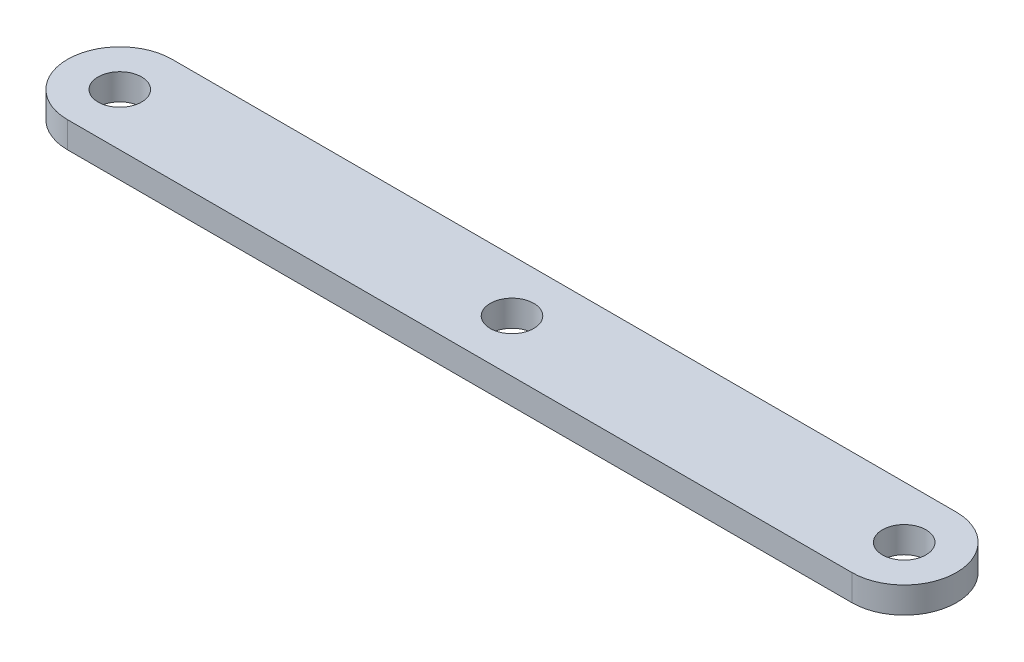
ISO-10303-21;
HEADER;
FILE_DESCRIPTION(('STEP AP214'),'2;1');
FILE_NAME('part.step','',(''),(''),'','','');
FILE_SCHEMA(('AUTOMOTIVE_DESIGN { 1 0 10303 214 1 1 1 1 }'));
ENDSEC;
DATA;
#1=APPLICATION_CONTEXT('core data for automotive mechanical design processes');
#2=APPLICATION_PROTOCOL_DEFINITION('international standard','automotive_design',2000,#1);
#3=PRODUCT_CONTEXT('',#1,'mechanical');
#4=PRODUCT('Part','Part','',(#3));
#5=PRODUCT_RELATED_PRODUCT_CATEGORY('part','',(#4));
#6=PRODUCT_DEFINITION_FORMATION('','',#4);
#7=PRODUCT_DEFINITION_CONTEXT('part definition',#1,'design');
#8=PRODUCT_DEFINITION('design','',#6,#7);
#9=PRODUCT_DEFINITION_SHAPE('','',#8);
#10=(LENGTH_UNIT() NAMED_UNIT(*) SI_UNIT(.MILLI.,.METRE.));
#11=(NAMED_UNIT(*) PLANE_ANGLE_UNIT() SI_UNIT($,.RADIAN.));
#12=(NAMED_UNIT(*) SI_UNIT($,.STERADIAN.) SOLID_ANGLE_UNIT());
#13=UNCERTAINTY_MEASURE_WITH_UNIT(LENGTH_MEASURE(1.E-05),#10,'distance_accuracy_value','');
#14=(GEOMETRIC_REPRESENTATION_CONTEXT(3) GLOBAL_UNCERTAINTY_ASSIGNED_CONTEXT((#13)) GLOBAL_UNIT_ASSIGNED_CONTEXT((#10,
#11,#12)) REPRESENTATION_CONTEXT('',''));
#15=CARTESIAN_POINT('',(0.,0.,0.));
#16=DIRECTION('',(0.,0.,1.));
#17=DIRECTION('',(1.,0.,0.));
#18=AXIS2_PLACEMENT_3D('',#15,#16,#17);
#19=CARTESIAN_POINT('',(-45.,3.,0.));
#20=DIRECTION('',(0.,-1.,0.));
#21=DIRECTION('',(0.,0.,-1.));
#22=AXIS2_PLACEMENT_3D('',#19,#20,#21);
#23=CYLINDRICAL_SURFACE('',#22,6.);
#24=CARTESIAN_POINT('',(-45.,0.,0.));
#25=DIRECTION('',(0.,1.,0.));
#26=DIRECTION('',(0.,0.,1.));
#27=AXIS2_PLACEMENT_3D('',#24,#25,#26);
#28=CIRCLE('',#27,6.);
#29=CARTESIAN_POINT('',(-45.,0.,-6.));
#30=VERTEX_POINT('',#29);
#31=CARTESIAN_POINT('',(-45.,0.,6.));
#32=VERTEX_POINT('',#31);
#33=EDGE_CURVE('E96',#30,#32,#28,.T.);
#34=ORIENTED_EDGE('',*,*,#33,.T.);
#35=DIRECTION('',(0.,-1.,0.));
#36=VECTOR('',#35,1.);
#37=CARTESIAN_POINT('',(-45.,3.,6.));
#38=LINE('',#37,#36);
#39=CARTESIAN_POINT('',(-45.,3.,6.));
#40=VERTEX_POINT('',#39);
#41=EDGE_CURVE('E11',#40,#32,#38,.T.);
#42=ORIENTED_EDGE('',*,*,#41,.F.);
#43=CARTESIAN_POINT('',(-45.,3.,0.));
#44=DIRECTION('',(0.,1.,0.));
#45=DIRECTION('',(0.,0.,1.));
#46=AXIS2_PLACEMENT_3D('',#43,#44,#45);
#47=CIRCLE('',#46,6.);
#48=CARTESIAN_POINT('',(-45.,3.,-6.));
#49=VERTEX_POINT('',#48);
#50=EDGE_CURVE('E84',#49,#40,#47,.T.);
#51=ORIENTED_EDGE('',*,*,#50,.F.);
#52=DIRECTION('',(0.,-1.,0.));
#53=VECTOR('',#52,1.);
#54=CARTESIAN_POINT('',(-45.,3.,-6.));
#55=LINE('',#54,#53);
#56=EDGE_CURVE('E92',#49,#30,#55,.T.);
#57=ORIENTED_EDGE('',*,*,#56,.T.);
#58=EDGE_LOOP('',(#34,#42,#51,#57));
#59=FACE_BOUND('',#58,.T.);
#60=ADVANCED_FACE('F33',(#59),#23,.T.);
#61=CARTESIAN_POINT('',(-45.,3.,6.));
#62=DIRECTION('',(0.,0.,-1.));
#63=DIRECTION('',(-1.,0.,0.));
#64=AXIS2_PLACEMENT_3D('',#61,#62,#63);
#65=PLANE('',#64);
#66=DIRECTION('',(1.,0.,0.));
#67=VECTOR('',#66,1.);
#68=CARTESIAN_POINT('',(-45.,0.,6.));
#69=LINE('',#68,#67);
#70=CARTESIAN_POINT('',(45.,0.,6.));
#71=VERTEX_POINT('',#70);
#72=EDGE_CURVE('E88',#32,#71,#69,.T.);
#73=ORIENTED_EDGE('',*,*,#72,.T.);
#74=DIRECTION('',(0.,-1.,0.));
#75=VECTOR('',#74,1.);
#76=CARTESIAN_POINT('',(45.,3.,6.));
#77=LINE('',#76,#75);
#78=CARTESIAN_POINT('',(45.,3.,6.));
#79=VERTEX_POINT('',#78);
#80=EDGE_CURVE('E41',#79,#71,#77,.T.);
#81=ORIENTED_EDGE('',*,*,#80,.F.);
#82=DIRECTION('',(1.,0.,0.));
#83=VECTOR('',#82,1.);
#84=CARTESIAN_POINT('',(-45.,3.,6.));
#85=LINE('',#84,#83);
#86=EDGE_CURVE('E79',#40,#79,#85,.T.);
#87=ORIENTED_EDGE('',*,*,#86,.F.);
#88=ORIENTED_EDGE('',*,*,#41,.T.);
#89=EDGE_LOOP('',(#73,#81,#87,#88));
#90=FACE_BOUND('',#89,.T.);
#91=ADVANCED_FACE('F87',(#90),#65,.F.);
#92=CARTESIAN_POINT('',(45.,3.,0.));
#93=DIRECTION('',(0.,-1.,0.));
#94=DIRECTION('',(0.,0.,-1.));
#95=AXIS2_PLACEMENT_3D('',#92,#93,#94);
#96=CYLINDRICAL_SURFACE('',#95,6.);
#97=CARTESIAN_POINT('',(45.,0.,0.));
#98=DIRECTION('',(0.,1.,0.));
#99=DIRECTION('',(0.,0.,1.));
#100=AXIS2_PLACEMENT_3D('',#97,#98,#99);
#101=CIRCLE('',#100,6.);
#102=CARTESIAN_POINT('',(45.,0.,-6.));
#103=VERTEX_POINT('',#102);
#104=EDGE_CURVE('E66',#71,#103,#101,.T.);
#105=ORIENTED_EDGE('',*,*,#104,.T.);
#106=DIRECTION('',(0.,-1.,0.));
#107=VECTOR('',#106,1.);
#108=CARTESIAN_POINT('',(45.,3.,-6.));
#109=LINE('',#108,#107);
#110=CARTESIAN_POINT('',(45.,3.,-6.));
#111=VERTEX_POINT('',#110);
#112=EDGE_CURVE('E89',#111,#103,#109,.T.);
#113=ORIENTED_EDGE('',*,*,#112,.F.);
#114=CARTESIAN_POINT('',(45.,3.,0.));
#115=DIRECTION('',(0.,1.,0.));
#116=DIRECTION('',(0.,0.,1.));
#117=AXIS2_PLACEMENT_3D('',#114,#115,#116);
#118=CIRCLE('',#117,6.);
#119=EDGE_CURVE('E82',#79,#111,#118,.T.);
#120=ORIENTED_EDGE('',*,*,#119,.F.);
#121=ORIENTED_EDGE('',*,*,#80,.T.);
#122=EDGE_LOOP('',(#105,#113,#120,#121));
#123=FACE_BOUND('',#122,.T.);
#124=ADVANCED_FACE('F90',(#123),#96,.T.);
#125=CARTESIAN_POINT('',(-45.,3.,-6.));
#126=DIRECTION('',(0.,0.,1.));
#127=DIRECTION('',(1.,0.,0.));
#128=AXIS2_PLACEMENT_3D('',#125,#126,#127);
#129=PLANE('',#128);
#130=DIRECTION('',(-1.,0.,0.));
#131=VECTOR('',#130,1.);
#132=CARTESIAN_POINT('',(-45.,0.,-6.));
#133=LINE('',#132,#131);
#134=EDGE_CURVE('E72',#103,#30,#133,.T.);
#135=ORIENTED_EDGE('',*,*,#134,.T.);
#136=ORIENTED_EDGE('',*,*,#56,.F.);
#137=DIRECTION('',(-1.,0.,0.));
#138=VECTOR('',#137,1.);
#139=CARTESIAN_POINT('',(-45.,3.,-6.));
#140=LINE('',#139,#138);
#141=EDGE_CURVE('E49',#111,#49,#140,.T.);
#142=ORIENTED_EDGE('',*,*,#141,.F.);
#143=ORIENTED_EDGE('',*,*,#112,.T.);
#144=EDGE_LOOP('',(#135,#136,#142,#143));
#145=FACE_BOUND('',#144,.T.);
#146=ADVANCED_FACE('F104',(#145),#129,.F.);
#147=CARTESIAN_POINT('',(-45.,3.,0.));
#148=DIRECTION('',(0.,1.,0.));
#149=DIRECTION('',(0.,0.,1.));
#150=AXIS2_PLACEMENT_3D('',#147,#148,#149);
#151=PLANE('',#150);
#152=CARTESIAN_POINT('',(-45.,3.,0.));
#153=DIRECTION('',(0.,1.,0.));
#154=DIRECTION('',(0.,0.,1.));
#155=AXIS2_PLACEMENT_3D('',#152,#153,#154);
#156=CIRCLE('',#155,2.5);
#157=CARTESIAN_POINT('',(-45.,3.,2.5));
#158=VERTEX_POINT('',#157);
#159=EDGE_CURVE('E120',#158,#158,#156,.T.);
#160=ORIENTED_EDGE('',*,*,#159,.F.);
#161=EDGE_LOOP('',(#160));
#162=FACE_BOUND('',#161,.T.);
#163=CARTESIAN_POINT('',(45.,3.,0.));
#164=DIRECTION('',(0.,1.,0.));
#165=DIRECTION('',(0.,0.,1.));
#166=AXIS2_PLACEMENT_3D('',#163,#164,#165);
#167=CIRCLE('',#166,2.5);
#168=CARTESIAN_POINT('',(45.,3.,2.5));
#169=VERTEX_POINT('',#168);
#170=EDGE_CURVE('E113',#169,#169,#167,.T.);
#171=ORIENTED_EDGE('',*,*,#170,.F.);
#172=EDGE_LOOP('',(#171));
#173=FACE_BOUND('',#172,.T.);
#174=CARTESIAN_POINT('',(0.,3.,0.));
#175=DIRECTION('',(0.,1.,0.));
#176=DIRECTION('',(0.,0.,1.));
#177=AXIS2_PLACEMENT_3D('',#174,#175,#176);
#178=CIRCLE('',#177,2.5);
#179=CARTESIAN_POINT('',(0.,3.,2.5));
#180=VERTEX_POINT('',#179);
#181=EDGE_CURVE('E114',#180,#180,#178,.T.);
#182=ORIENTED_EDGE('',*,*,#181,.F.);
#183=EDGE_LOOP('',(#182));
#184=FACE_BOUND('',#183,.T.);
#185=ORIENTED_EDGE('',*,*,#50,.T.);
#186=ORIENTED_EDGE('',*,*,#86,.T.);
#187=ORIENTED_EDGE('',*,*,#119,.T.);
#188=ORIENTED_EDGE('',*,*,#141,.T.);
#189=EDGE_LOOP('',(#185,#186,#187,#188));
#190=FACE_BOUND('',#189,.T.);
#191=ADVANCED_FACE('F80',(#162,#173,#184,#190),#151,.T.);
#192=CARTESIAN_POINT('',(-45.,0.,0.));
#193=DIRECTION('',(0.,1.,0.));
#194=DIRECTION('',(0.,0.,1.));
#195=AXIS2_PLACEMENT_3D('',#192,#193,#194);
#196=PLANE('',#195);
#197=CARTESIAN_POINT('',(-45.,0.,0.));
#198=DIRECTION('',(0.,1.,0.));
#199=DIRECTION('',(0.,0.,1.));
#200=AXIS2_PLACEMENT_3D('',#197,#198,#199);
#201=CIRCLE('',#200,2.5);
#202=CARTESIAN_POINT('',(-45.,0.,2.5));
#203=VERTEX_POINT('',#202);
#204=EDGE_CURVE('E99',#203,#203,#201,.F.);
#205=ORIENTED_EDGE('',*,*,#204,.F.);
#206=EDGE_LOOP('',(#205));
#207=FACE_BOUND('',#206,.T.);
#208=CARTESIAN_POINT('',(45.,0.,0.));
#209=DIRECTION('',(0.,1.,0.));
#210=DIRECTION('',(0.,0.,1.));
#211=AXIS2_PLACEMENT_3D('',#208,#209,#210);
#212=CIRCLE('',#211,2.5);
#213=CARTESIAN_POINT('',(45.,0.,2.5));
#214=VERTEX_POINT('',#213);
#215=EDGE_CURVE('E117',#214,#214,#212,.F.);
#216=ORIENTED_EDGE('',*,*,#215,.F.);
#217=EDGE_LOOP('',(#216));
#218=FACE_BOUND('',#217,.T.);
#219=CARTESIAN_POINT('',(0.,0.,0.));
#220=DIRECTION('',(0.,1.,0.));
#221=DIRECTION('',(0.,0.,1.));
#222=AXIS2_PLACEMENT_3D('',#219,#220,#221);
#223=CIRCLE('',#222,2.5);
#224=CARTESIAN_POINT('',(0.,0.,2.5));
#225=VERTEX_POINT('',#224);
#226=EDGE_CURVE('E110',#225,#225,#223,.F.);
#227=ORIENTED_EDGE('',*,*,#226,.F.);
#228=EDGE_LOOP('',(#227));
#229=FACE_BOUND('',#228,.T.);
#230=ORIENTED_EDGE('',*,*,#33,.F.);
#231=ORIENTED_EDGE('',*,*,#134,.F.);
#232=ORIENTED_EDGE('',*,*,#104,.F.);
#233=ORIENTED_EDGE('',*,*,#72,.F.);
#234=EDGE_LOOP('',(#230,#231,#232,#233));
#235=FACE_BOUND('',#234,.T.);
#236=ADVANCED_FACE('F107',(#207,#218,#229,#235),#196,.F.);
#237=CARTESIAN_POINT('',(0.,-0.00100000000000013,0.));
#238=DIRECTION('',(0.,1.,0.));
#239=DIRECTION('',(0.,0.,1.));
#240=AXIS2_PLACEMENT_3D('',#237,#238,#239);
#241=CYLINDRICAL_SURFACE('',#240,2.5);
#242=ORIENTED_EDGE('',*,*,#181,.T.);
#243=EDGE_LOOP('',(#242));
#244=FACE_BOUND('',#243,.T.);
#245=ORIENTED_EDGE('',*,*,#226,.T.);
#246=EDGE_LOOP('',(#245));
#247=FACE_BOUND('',#246,.T.);
#248=ADVANCED_FACE('F138',(#244,#247),#241,.F.);
#249=CARTESIAN_POINT('',(45.,-0.00100000000000013,0.));
#250=DIRECTION('',(0.,1.,0.));
#251=DIRECTION('',(0.,0.,1.));
#252=AXIS2_PLACEMENT_3D('',#249,#250,#251);
#253=CYLINDRICAL_SURFACE('',#252,2.5);
#254=ORIENTED_EDGE('',*,*,#170,.T.);
#255=EDGE_LOOP('',(#254));
#256=FACE_BOUND('',#255,.T.);
#257=ORIENTED_EDGE('',*,*,#215,.T.);
#258=EDGE_LOOP('',(#257));
#259=FACE_BOUND('',#258,.T.);
#260=ADVANCED_FACE('F141',(#256,#259),#253,.F.);
#261=CARTESIAN_POINT('',(-45.,-0.00100000000000013,0.));
#262=DIRECTION('',(0.,1.,0.));
#263=DIRECTION('',(0.,0.,1.));
#264=AXIS2_PLACEMENT_3D('',#261,#262,#263);
#265=CYLINDRICAL_SURFACE('',#264,2.5);
#266=ORIENTED_EDGE('',*,*,#159,.T.);
#267=EDGE_LOOP('',(#266));
#268=FACE_BOUND('',#267,.T.);
#269=ORIENTED_EDGE('',*,*,#204,.T.);
#270=EDGE_LOOP('',(#269));
#271=FACE_BOUND('',#270,.T.);
#272=ADVANCED_FACE('F128',(#268,#271),#265,.F.);
#273=CLOSED_SHELL('',(#60,#91,#124,#146,#191,#236,#248,#260,#272));
#274=MANIFOLD_SOLID_BREP('B2',#273);
#275=ADVANCED_BREP_SHAPE_REPRESENTATION('',(#18,#274),#14);
#276=SHAPE_DEFINITION_REPRESENTATION(#9,#275);
ENDSEC;
END-ISO-10303-21;
